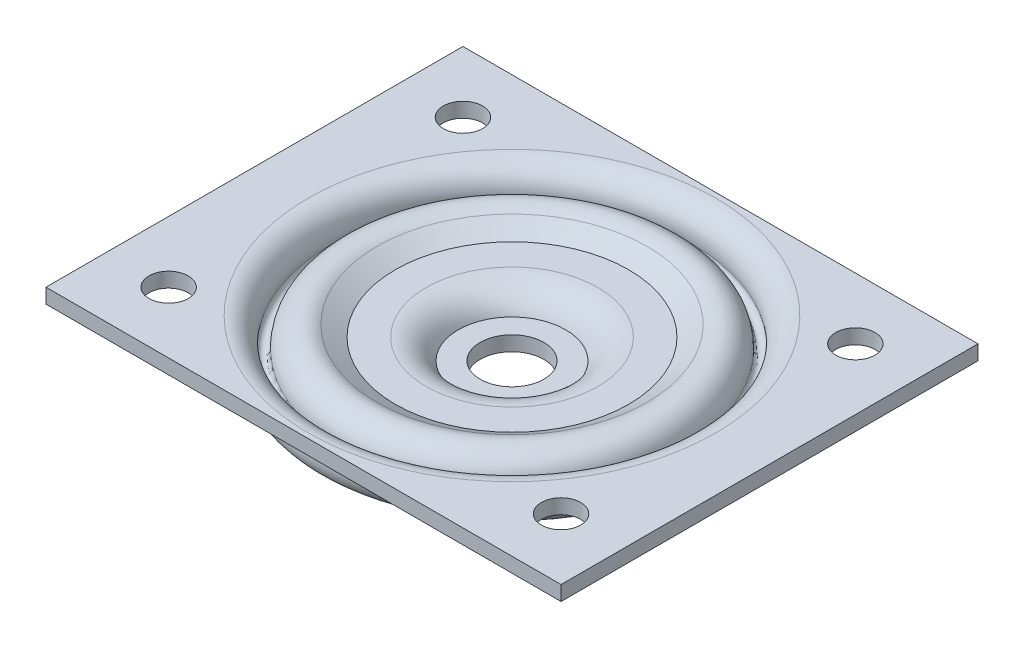
ISO-10303-21;
HEADER;
FILE_DESCRIPTION(('STEP AP214'),'2;1');
FILE_NAME('part.step','',(''),(''),'','','');
FILE_SCHEMA(('AUTOMOTIVE_DESIGN { 1 0 10303 214 1 1 1 1 }'));
ENDSEC;
DATA;
#1=APPLICATION_CONTEXT('core data for automotive mechanical design processes');
#2=APPLICATION_PROTOCOL_DEFINITION('international standard','automotive_design',2000,#1);
#3=PRODUCT_CONTEXT('',#1,'mechanical');
#4=PRODUCT('Part','Part','',(#3));
#5=PRODUCT_RELATED_PRODUCT_CATEGORY('part','',(#4));
#6=PRODUCT_DEFINITION_FORMATION('','',#4);
#7=PRODUCT_DEFINITION_CONTEXT('part definition',#1,'design');
#8=PRODUCT_DEFINITION('design','',#6,#7);
#9=PRODUCT_DEFINITION_SHAPE('','',#8);
#10=(LENGTH_UNIT() NAMED_UNIT(*) SI_UNIT(.MILLI.,.METRE.));
#11=(NAMED_UNIT(*) PLANE_ANGLE_UNIT() SI_UNIT($,.RADIAN.));
#12=(NAMED_UNIT(*) SI_UNIT($,.STERADIAN.) SOLID_ANGLE_UNIT());
#13=UNCERTAINTY_MEASURE_WITH_UNIT(LENGTH_MEASURE(1.E-05),#10,'distance_accuracy_value','');
#14=(GEOMETRIC_REPRESENTATION_CONTEXT(3) GLOBAL_UNCERTAINTY_ASSIGNED_CONTEXT((#13)) GLOBAL_UNIT_ASSIGNED_CONTEXT((#10,
#11,#12)) REPRESENTATION_CONTEXT('',''));
#15=CARTESIAN_POINT('',(0.,0.,0.));
#16=DIRECTION('',(0.,0.,1.));
#17=DIRECTION('',(1.,0.,0.));
#18=AXIS2_PLACEMENT_3D('',#15,#16,#17);
#19=CARTESIAN_POINT('',(41.5,11.,0.));
#20=DIRECTION('',(0.,1.,0.));
#21=DIRECTION('',(0.,0.,1.));
#22=AXIS2_PLACEMENT_3D('',#19,#20,#21);
#23=PLANE('',#22);
#24=CARTESIAN_POINT('',(-40.,11.,30.));
#25=DIRECTION('',(0.,1.,0.));
#26=DIRECTION('',(0.,0.,1.));
#27=AXIS2_PLACEMENT_3D('',#24,#25,#26);
#28=CIRCLE('',#27,4.00000000000001);
#29=CARTESIAN_POINT('',(-40.,11.,34.));
#30=VERTEX_POINT('',#29);
#31=EDGE_CURVE('E318',#30,#30,#28,.T.);
#32=ORIENTED_EDGE('',*,*,#31,.F.);
#33=EDGE_LOOP('',(#32));
#34=FACE_BOUND('',#33,.T.);
#35=CARTESIAN_POINT('',(40.,11.,30.));
#36=DIRECTION('',(0.,1.,0.));
#37=DIRECTION('',(0.,0.,1.));
#38=AXIS2_PLACEMENT_3D('',#35,#36,#37);
#39=CIRCLE('',#38,4.00000000000001);
#40=CARTESIAN_POINT('',(40.,11.,34.));
#41=VERTEX_POINT('',#40);
#42=EDGE_CURVE('E314',#41,#41,#39,.T.);
#43=ORIENTED_EDGE('',*,*,#42,.F.);
#44=EDGE_LOOP('',(#43));
#45=FACE_BOUND('',#44,.T.);
#46=CARTESIAN_POINT('',(40.,11.,-30.));
#47=DIRECTION('',(0.,1.,0.));
#48=DIRECTION('',(0.,0.,1.));
#49=AXIS2_PLACEMENT_3D('',#46,#47,#48);
#50=CIRCLE('',#49,4.00000000000001);
#51=CARTESIAN_POINT('',(40.,11.,-26.));
#52=VERTEX_POINT('',#51);
#53=EDGE_CURVE('E312',#52,#52,#50,.T.);
#54=ORIENTED_EDGE('',*,*,#53,.F.);
#55=EDGE_LOOP('',(#54));
#56=FACE_BOUND('',#55,.T.);
#57=CARTESIAN_POINT('',(-40.,11.,-30.));
#58=DIRECTION('',(0.,1.,0.));
#59=DIRECTION('',(0.,0.,1.));
#60=AXIS2_PLACEMENT_3D('',#57,#58,#59);
#61=CIRCLE('',#60,4.00000000000001);
#62=CARTESIAN_POINT('',(-40.,11.,-26.));
#63=VERTEX_POINT('',#62);
#64=EDGE_CURVE('E106',#63,#63,#61,.T.);
#65=ORIENTED_EDGE('',*,*,#64,.F.);
#66=EDGE_LOOP('',(#65));
#67=FACE_BOUND('',#66,.T.);
#68=CARTESIAN_POINT('',(0.,11.,0.));
#69=DIRECTION('',(0.,-1.,0.));
#70=DIRECTION('',(0.,0.,-1.));
#71=AXIS2_PLACEMENT_3D('',#68,#69,#70);
#72=CIRCLE('',#71,41.5);
#73=CARTESIAN_POINT('',(0.,11.,-41.5));
#74=VERTEX_POINT('',#73);
#75=EDGE_CURVE('E140',#74,#74,#72,.T.);
#76=ORIENTED_EDGE('',*,*,#75,.T.);
#77=EDGE_LOOP('',(#76));
#78=FACE_BOUND('',#77,.T.);
#79=DIRECTION('',(1.,0.,0.));
#80=VECTOR('',#79,1.);
#81=CARTESIAN_POINT('',(52.5,11.,42.5));
#82=LINE('',#81,#80);
#83=CARTESIAN_POINT('',(-52.500000043221,11.,42.5));
#84=VERTEX_POINT('',#83);
#85=CARTESIAN_POINT('',(52.5,11.,42.5));
#86=VERTEX_POINT('',#85);
#87=EDGE_CURVE('E116',#84,#86,#82,.T.);
#88=ORIENTED_EDGE('',*,*,#87,.T.);
#89=DIRECTION('',(0.,0.,1.));
#90=VECTOR('',#89,1.);
#91=CARTESIAN_POINT('',(52.5,11.,0.));
#92=LINE('',#91,#90);
#93=CARTESIAN_POINT('',(52.5,11.,-42.5));
#94=VERTEX_POINT('',#93);
#95=EDGE_CURVE('E95',#94,#86,#92,.T.);
#96=ORIENTED_EDGE('',*,*,#95,.F.);
#97=DIRECTION('',(-1.,0.,0.));
#98=VECTOR('',#97,1.);
#99=CARTESIAN_POINT('',(52.5,11.,-42.5));
#100=LINE('',#99,#98);
#101=CARTESIAN_POINT('',(-52.5000000432211,11.,-42.5));
#102=VERTEX_POINT('',#101);
#103=EDGE_CURVE('E56',#94,#102,#100,.T.);
#104=ORIENTED_EDGE('',*,*,#103,.T.);
#105=DIRECTION('',(0.,0.,1.));
#106=VECTOR('',#105,1.);
#107=CARTESIAN_POINT('',(-52.5000000432211,11.,0.));
#108=LINE('',#107,#106);
#109=EDGE_CURVE('E110',#102,#84,#108,.T.);
#110=ORIENTED_EDGE('',*,*,#109,.T.);
#111=EDGE_LOOP('',(#88,#96,#104,#110));
#112=FACE_BOUND('',#111,.T.);
#113=ADVANCED_FACE('F39',(#34,#45,#56,#67,#78,#112),#23,.T.);
#114=CARTESIAN_POINT('',(41.5,8.,0.));
#115=DIRECTION('',(0.,-1.,0.));
#116=DIRECTION('',(0.,0.,-1.));
#117=AXIS2_PLACEMENT_3D('',#114,#115,#116);
#118=PLANE('',#117);
#119=CARTESIAN_POINT('',(-40.,8.,30.));
#120=DIRECTION('',(0.,-1.,0.));
#121=DIRECTION('',(0.,0.,-1.));
#122=AXIS2_PLACEMENT_3D('',#119,#120,#121);
#123=CIRCLE('',#122,4.00000000000001);
#124=CARTESIAN_POINT('',(-40.,8.,26.));
#125=VERTEX_POINT('',#124);
#126=EDGE_CURVE('E43',#125,#125,#123,.T.);
#127=ORIENTED_EDGE('',*,*,#126,.F.);
#128=EDGE_LOOP('',(#127));
#129=FACE_BOUND('',#128,.T.);
#130=CARTESIAN_POINT('',(40.,8.,30.));
#131=DIRECTION('',(0.,-1.,0.));
#132=DIRECTION('',(0.,0.,-1.));
#133=AXIS2_PLACEMENT_3D('',#130,#131,#132);
#134=CIRCLE('',#133,4.00000000000001);
#135=CARTESIAN_POINT('',(40.,8.,26.));
#136=VERTEX_POINT('',#135);
#137=EDGE_CURVE('E103',#136,#136,#134,.T.);
#138=ORIENTED_EDGE('',*,*,#137,.F.);
#139=EDGE_LOOP('',(#138));
#140=FACE_BOUND('',#139,.T.);
#141=CARTESIAN_POINT('',(40.,8.,-30.));
#142=DIRECTION('',(0.,-1.,0.));
#143=DIRECTION('',(0.,0.,-1.));
#144=AXIS2_PLACEMENT_3D('',#141,#142,#143);
#145=CIRCLE('',#144,4.00000000000001);
#146=CARTESIAN_POINT('',(40.,8.,-34.));
#147=VERTEX_POINT('',#146);
#148=EDGE_CURVE('E169',#147,#147,#145,.T.);
#149=ORIENTED_EDGE('',*,*,#148,.F.);
#150=EDGE_LOOP('',(#149));
#151=FACE_BOUND('',#150,.T.);
#152=CARTESIAN_POINT('',(-40.,8.,-30.));
#153=DIRECTION('',(0.,-1.,0.));
#154=DIRECTION('',(0.,0.,-1.));
#155=AXIS2_PLACEMENT_3D('',#152,#153,#154);
#156=CIRCLE('',#155,4.00000000000001);
#157=CARTESIAN_POINT('',(-40.,8.,-34.));
#158=VERTEX_POINT('',#157);
#159=EDGE_CURVE('E166',#158,#158,#156,.T.);
#160=ORIENTED_EDGE('',*,*,#159,.F.);
#161=EDGE_LOOP('',(#160));
#162=FACE_BOUND('',#161,.T.);
#163=CARTESIAN_POINT('',(0.,8.,0.));
#164=DIRECTION('',(0.,-1.,0.));
#165=DIRECTION('',(0.,0.,-1.));
#166=AXIS2_PLACEMENT_3D('',#163,#164,#165);
#167=CIRCLE('',#166,41.5);
#168=CARTESIAN_POINT('',(0.,8.,-41.5));
#169=VERTEX_POINT('',#168);
#170=EDGE_CURVE('E137',#169,#169,#167,.T.);
#171=ORIENTED_EDGE('',*,*,#170,.F.);
#172=EDGE_LOOP('',(#171));
#173=FACE_BOUND('',#172,.T.);
#174=DIRECTION('',(-1.,0.,0.));
#175=VECTOR('',#174,1.);
#176=CARTESIAN_POINT('',(41.5,8.,42.5));
#177=LINE('',#176,#175);
#178=CARTESIAN_POINT('',(52.5,8.,42.5));
#179=VERTEX_POINT('',#178);
#180=CARTESIAN_POINT('',(-52.500000043221,8.,42.5));
#181=VERTEX_POINT('',#180);
#182=EDGE_CURVE('E49',#179,#181,#177,.T.);
#183=ORIENTED_EDGE('',*,*,#182,.T.);
#184=DIRECTION('',(0.,0.,1.));
#185=VECTOR('',#184,1.);
#186=CARTESIAN_POINT('',(-52.5000000432211,8.,0.));
#187=LINE('',#186,#185);
#188=CARTESIAN_POINT('',(-52.5000000432211,8.,-42.5));
#189=VERTEX_POINT('',#188);
#190=EDGE_CURVE('E112',#189,#181,#187,.T.);
#191=ORIENTED_EDGE('',*,*,#190,.F.);
#192=DIRECTION('',(1.,0.,0.));
#193=VECTOR('',#192,1.);
#194=CARTESIAN_POINT('',(41.5,8.,-42.5));
#195=LINE('',#194,#193);
#196=CARTESIAN_POINT('',(52.5,8.,-42.5));
#197=VERTEX_POINT('',#196);
#198=EDGE_CURVE('E12',#189,#197,#195,.T.);
#199=ORIENTED_EDGE('',*,*,#198,.T.);
#200=DIRECTION('',(0.,0.,1.));
#201=VECTOR('',#200,1.);
#202=CARTESIAN_POINT('',(52.5,8.,0.));
#203=LINE('',#202,#201);
#204=EDGE_CURVE('E90',#197,#179,#203,.T.);
#205=ORIENTED_EDGE('',*,*,#204,.T.);
#206=EDGE_LOOP('',(#183,#191,#199,#205));
#207=FACE_BOUND('',#206,.T.);
#208=ADVANCED_FACE('F91',(#129,#140,#151,#162,#173,#207),#118,.T.);
#209=CARTESIAN_POINT('',(6.5,0.,0.));
#210=DIRECTION('',(0.,-1.,0.));
#211=DIRECTION('',(0.,0.,-1.));
#212=AXIS2_PLACEMENT_3D('',#209,#210,#211);
#213=PLANE('',#212);
#214=CARTESIAN_POINT('',(0.,0.,0.));
#215=DIRECTION('',(0.,-1.,0.));
#216=DIRECTION('',(0.,0.,-1.));
#217=AXIS2_PLACEMENT_3D('',#214,#215,#216);
#218=CIRCLE('',#217,13.3);
#219=CARTESIAN_POINT('',(0.,0.,-13.3));
#220=VERTEX_POINT('',#219);
#221=EDGE_CURVE('E119',#220,#220,#218,.T.);
#222=ORIENTED_EDGE('',*,*,#221,.T.);
#223=EDGE_LOOP('',(#222));
#224=FACE_BOUND('',#223,.T.);
#225=CARTESIAN_POINT('',(0.,0.,0.));
#226=DIRECTION('',(0.,-1.,0.));
#227=DIRECTION('',(0.,0.,-1.));
#228=AXIS2_PLACEMENT_3D('',#225,#226,#227);
#229=CIRCLE('',#228,6.5);
#230=CARTESIAN_POINT('',(0.,0.,-6.5));
#231=VERTEX_POINT('',#230);
#232=EDGE_CURVE('E87',#231,#231,#229,.T.);
#233=ORIENTED_EDGE('',*,*,#232,.F.);
#234=EDGE_LOOP('',(#233));
#235=FACE_BOUND('',#234,.T.);
#236=ADVANCED_FACE('F41',(#224,#235),#213,.T.);
#237=CARTESIAN_POINT('',(0.,0.,0.));
#238=DIRECTION('',(0.,-1.,0.));
#239=DIRECTION('',(0.,0.,-1.));
#240=AXIS2_PLACEMENT_3D('',#237,#238,#239);
#241=CYLINDRICAL_SURFACE('',#240,6.5);
#242=ORIENTED_EDGE('',*,*,#232,.T.);
#243=EDGE_LOOP('',(#242));
#244=FACE_BOUND('',#243,.T.);
#245=CARTESIAN_POINT('',(0.,3.,0.));
#246=DIRECTION('',(0.,-1.,0.));
#247=DIRECTION('',(0.,0.,-1.));
#248=AXIS2_PLACEMENT_3D('',#245,#246,#247);
#249=CIRCLE('',#248,6.5);
#250=CARTESIAN_POINT('',(0.,3.,-6.5));
#251=VERTEX_POINT('',#250);
#252=EDGE_CURVE('E161',#251,#251,#249,.T.);
#253=ORIENTED_EDGE('',*,*,#252,.F.);
#254=EDGE_LOOP('',(#253));
#255=FACE_BOUND('',#254,.T.);
#256=ADVANCED_FACE('F226',(#244,#255),#241,.F.);
#257=CARTESIAN_POINT('',(6.5,3.,0.));
#258=DIRECTION('',(0.,1.,0.));
#259=DIRECTION('',(0.,0.,1.));
#260=AXIS2_PLACEMENT_3D('',#257,#258,#259);
#261=PLANE('',#260);
#262=ORIENTED_EDGE('',*,*,#252,.T.);
#263=EDGE_LOOP('',(#262));
#264=FACE_BOUND('',#263,.T.);
#265=CARTESIAN_POINT('',(0.,3.,0.));
#266=DIRECTION('',(0.,-1.,0.));
#267=DIRECTION('',(0.,0.,-1.));
#268=AXIS2_PLACEMENT_3D('',#265,#266,#267);
#269=CIRCLE('',#268,10.9547727312186);
#270=CARTESIAN_POINT('',(0.,3.,-10.9547727312186));
#271=VERTEX_POINT('',#270);
#272=EDGE_CURVE('E158',#271,#271,#269,.T.);
#273=ORIENTED_EDGE('',*,*,#272,.F.);
#274=EDGE_LOOP('',(#273));
#275=FACE_BOUND('',#274,.T.);
#276=ADVANCED_FACE('F231',(#264,#275),#261,.T.);
#277=CARTESIAN_POINT('',(0.,0.,0.));
#278=DIRECTION('',(0.,-1.,0.));
#279=DIRECTION('',(0.,0.,-1.));
#280=AXIS2_PLACEMENT_3D('',#277,#278,#279);
#281=TOROIDAL_SURFACE('',#280,17.5,7.2);
#282=ORIENTED_EDGE('',*,*,#272,.T.);
#283=EDGE_LOOP('',(#282));
#284=FACE_BOUND('',#283,.T.);
#285=CARTESIAN_POINT('',(0.,7.2,0.));
#286=DIRECTION('',(0.,-1.,0.));
#287=DIRECTION('',(0.,0.,-1.));
#288=AXIS2_PLACEMENT_3D('',#285,#286,#287);
#289=CIRCLE('',#288,17.5);
#290=CARTESIAN_POINT('',(0.,7.2,-17.5));
#291=VERTEX_POINT('',#290);
#292=EDGE_CURVE('E155',#291,#291,#289,.T.);
#293=ORIENTED_EDGE('',*,*,#292,.F.);
#294=EDGE_LOOP('',(#293));
#295=FACE_BOUND('',#294,.T.);
#296=ADVANCED_FACE('F236',(#284,#295),#281,.T.);
#297=CARTESIAN_POINT('',(17.5,7.2,0.));
#298=DIRECTION('',(0.,1.,0.));
#299=DIRECTION('',(0.,0.,1.));
#300=AXIS2_PLACEMENT_3D('',#297,#298,#299);
#301=PLANE('',#300);
#302=ORIENTED_EDGE('',*,*,#292,.T.);
#303=EDGE_LOOP('',(#302));
#304=FACE_BOUND('',#303,.T.);
#305=CARTESIAN_POINT('',(0.,7.2,0.));
#306=DIRECTION('',(0.,-1.,0.));
#307=DIRECTION('',(0.,0.,-1.));
#308=AXIS2_PLACEMENT_3D('',#305,#306,#307);
#309=CIRCLE('',#308,23.7791125789599);
#310=CARTESIAN_POINT('',(0.,7.2,-23.7791125789599));
#311=VERTEX_POINT('',#310);
#312=EDGE_CURVE('E152',#311,#311,#309,.T.);
#313=ORIENTED_EDGE('',*,*,#312,.F.);
#314=EDGE_LOOP('',(#313));
#315=FACE_BOUND('',#314,.T.);
#316=ADVANCED_FACE('F242',(#304,#315),#301,.T.);
#317=CARTESIAN_POINT('',(0.,9.42957114887785,0.));
#318=DIRECTION('',(0.,1.,0.));
#319=DIRECTION('',(0.,0.,1.));
#320=AXIS2_PLACEMENT_3D('',#317,#318,#319);
#321=CONICAL_SURFACE('',#320,27.5481495211106,1.03661375188951);
#322=ORIENTED_EDGE('',*,*,#312,.T.);
#323=EDGE_LOOP('',(#322));
#324=FACE_BOUND('',#323,.T.);
#325=CARTESIAN_POINT('',(0.,9.42957114887785,0.));
#326=DIRECTION('',(0.,-1.,0.));
#327=DIRECTION('',(0.,0.,-1.));
#328=AXIS2_PLACEMENT_3D('',#325,#326,#327);
#329=CIRCLE('',#328,27.5481495211106);
#330=CARTESIAN_POINT('',(0.,9.42957114887785,-27.5481495211106));
#331=VERTEX_POINT('',#330);
#332=EDGE_CURVE('E149',#331,#331,#329,.T.);
#333=ORIENTED_EDGE('',*,*,#332,.F.);
#334=EDGE_LOOP('',(#333));
#335=FACE_BOUND('',#334,.T.);
#336=ADVANCED_FACE('F248',(#324,#335),#321,.F.);
#337=CARTESIAN_POINT('',(0.,5.28458748990371,0.));
#338=DIRECTION('',(0.,-1.,0.));
#339=DIRECTION('',(0.,0.,-1.));
#340=AXIS2_PLACEMENT_3D('',#337,#338,#339);
#341=TOROIDAL_SURFACE('',#340,30.0001116855741,4.81591195819895);
#342=ORIENTED_EDGE('',*,*,#332,.T.);
#343=EDGE_LOOP('',(#342));
#344=FACE_BOUND('',#343,.T.);
#345=CARTESIAN_POINT('',(0.,5.0388465615535,0.));
#346=DIRECTION('',(0.,-1.,0.));
#347=DIRECTION('',(0.,0.,-1.));
#348=AXIS2_PLACEMENT_3D('',#345,#346,#347);
#349=CIRCLE('',#348,34.809749861701);
#350=CARTESIAN_POINT('',(0.,5.0388465615535,-34.809749861701));
#351=VERTEX_POINT('',#350);
#352=EDGE_CURVE('E146',#351,#351,#349,.T.);
#353=ORIENTED_EDGE('',*,*,#352,.F.);
#354=EDGE_LOOP('',(#353));
#355=FACE_BOUND('',#354,.T.);
#356=ADVANCED_FACE('F254',(#344,#355),#341,.T.);
#357=CARTESIAN_POINT('',(0.,4.98781968845384,0.));
#358=DIRECTION('',(0.,-1.,0.));
#359=DIRECTION('',(0.,0.,-1.));
#360=AXIS2_PLACEMENT_3D('',#357,#358,#359);
#361=TOROIDAL_SURFACE('',#360,35.8084471422729,0.999999999999998);
#362=ORIENTED_EDGE('',*,*,#352,.T.);
#363=EDGE_LOOP('',(#362));
#364=FACE_BOUND('',#363,.T.);
#365=CARTESIAN_POINT('',(0.,5.19350855753322,0.));
#366=DIRECTION('',(0.,-1.,0.));
#367=DIRECTION('',(0.,0.,-1.));
#368=AXIS2_PLACEMENT_3D('',#365,#366,#367);
#369=CIRCLE('',#368,36.7870645798535);
#370=CARTESIAN_POINT('',(0.,5.19350855753322,-36.7870645798535));
#371=VERTEX_POINT('',#370);
#372=EDGE_CURVE('E143',#371,#371,#369,.T.);
#373=ORIENTED_EDGE('',*,*,#372,.F.);
#374=EDGE_LOOP('',(#373));
#375=FACE_BOUND('',#374,.T.);
#376=ADVANCED_FACE('F260',(#364,#375),#361,.F.);
#377=CARTESIAN_POINT('',(0.,6.18408804180105,0.));
#378=DIRECTION('',(0.,-1.,0.));
#379=DIRECTION('',(0.,0.,-1.));
#380=AXIS2_PLACEMENT_3D('',#377,#378,#379);
#381=TOROIDAL_SURFACE('',#380,41.5,4.81591195819894);
#382=ORIENTED_EDGE('',*,*,#372,.T.);
#383=EDGE_LOOP('',(#382));
#384=FACE_BOUND('',#383,.T.);
#385=ORIENTED_EDGE('',*,*,#75,.F.);
#386=EDGE_LOOP('',(#385));
#387=FACE_BOUND('',#386,.T.);
#388=ADVANCED_FACE('F191',(#384,#387),#381,.T.);
#389=CARTESIAN_POINT('',(0.,6.18408804180105,0.));
#390=DIRECTION('',(0.,-1.,0.));
#391=DIRECTION('',(0.,0.,-1.));
#392=AXIS2_PLACEMENT_3D('',#389,#390,#391);
#393=TOROIDAL_SURFACE('',#392,41.5,1.81591195819894);
#394=ORIENTED_EDGE('',*,*,#170,.T.);
#395=EDGE_LOOP('',(#394));
#396=FACE_BOUND('',#395,.T.);
#397=CARTESIAN_POINT('',(0.,5.81057516477138,0.));
#398=DIRECTION('',(0.,-1.,0.));
#399=DIRECTION('',(0.,0.,-1.));
#400=AXIS2_PLACEMENT_3D('',#397,#398,#399);
#401=CIRCLE('',#400,39.7229168925954);
#402=CARTESIAN_POINT('',(0.,5.81057516477138,-39.7229168925954));
#403=VERTEX_POINT('',#402);
#404=EDGE_CURVE('E134',#403,#403,#401,.T.);
#405=ORIENTED_EDGE('',*,*,#404,.F.);
#406=EDGE_LOOP('',(#405));
#407=FACE_BOUND('',#406,.T.);
#408=ADVANCED_FACE('F187',(#396,#407),#393,.F.);
#409=CARTESIAN_POINT('',(0.,4.98781968845384,0.));
#410=DIRECTION('',(0.,-1.,0.));
#411=DIRECTION('',(0.,0.,-1.));
#412=AXIS2_PLACEMENT_3D('',#409,#410,#411);
#413=TOROIDAL_SURFACE('',#412,35.8084471422729,4.);
#414=ORIENTED_EDGE('',*,*,#404,.T.);
#415=EDGE_LOOP('',(#414));
#416=FACE_BOUND('',#415,.T.);
#417=CARTESIAN_POINT('',(0.,5.19192718085252,0.));
#418=DIRECTION('',(0.,-1.,0.));
#419=DIRECTION('',(0.,0.,-1.));
#420=AXIS2_PLACEMENT_3D('',#417,#418,#419);
#421=CIRCLE('',#420,31.8136580199854);
#422=CARTESIAN_POINT('',(0.,5.19192718085252,-31.8136580199854));
#423=VERTEX_POINT('',#422);
#424=EDGE_CURVE('E131',#423,#423,#421,.T.);
#425=ORIENTED_EDGE('',*,*,#424,.F.);
#426=EDGE_LOOP('',(#425));
#427=FACE_BOUND('',#426,.T.);
#428=ADVANCED_FACE('F190',(#416,#427),#413,.T.);
#429=CARTESIAN_POINT('',(0.,5.28458748990371,0.));
#430=DIRECTION('',(0.,-1.,0.));
#431=DIRECTION('',(0.,0.,-1.));
#432=AXIS2_PLACEMENT_3D('',#429,#430,#431);
#433=TOROIDAL_SURFACE('',#432,30.0001116855741,1.81591195819895);
#434=ORIENTED_EDGE('',*,*,#424,.T.);
#435=EDGE_LOOP('',(#434));
#436=FACE_BOUND('',#435,.T.);
#437=CARTESIAN_POINT('',(0.,6.84751585283942,0.));
#438=DIRECTION('',(0.,-1.,0.));
#439=DIRECTION('',(0.,0.,-1.));
#440=AXIS2_PLACEMENT_3D('',#437,#438,#439);
#441=CIRCLE('',#440,29.0755625131333);
#442=CARTESIAN_POINT('',(0.,6.84751585283942,-29.0755625131333));
#443=VERTEX_POINT('',#442);
#444=EDGE_CURVE('E128',#443,#443,#441,.T.);
#445=ORIENTED_EDGE('',*,*,#444,.F.);
#446=EDGE_LOOP('',(#445));
#447=FACE_BOUND('',#446,.T.);
#448=ADVANCED_FACE('F197',(#436,#447),#433,.F.);
#449=CARTESIAN_POINT('',(0.,4.2,0.));
#450=DIRECTION('',(0.,1.,0.));
#451=DIRECTION('',(0.,0.,1.));
#452=AXIS2_PLACEMENT_3D('',#449,#450,#451);
#453=CONICAL_SURFACE('',#452,24.6,1.03661375188951);
#454=ORIENTED_EDGE('',*,*,#444,.T.);
#455=EDGE_LOOP('',(#454));
#456=FACE_BOUND('',#455,.T.);
#457=CARTESIAN_POINT('',(0.,4.2,0.));
#458=DIRECTION('',(0.,-1.,0.));
#459=DIRECTION('',(0.,0.,-1.));
#460=AXIS2_PLACEMENT_3D('',#457,#458,#459);
#461=CIRCLE('',#460,24.6);
#462=CARTESIAN_POINT('',(0.,4.2,-24.6));
#463=VERTEX_POINT('',#462);
#464=EDGE_CURVE('E125',#463,#463,#461,.T.);
#465=ORIENTED_EDGE('',*,*,#464,.F.);
#466=EDGE_LOOP('',(#465));
#467=FACE_BOUND('',#466,.T.);
#468=ADVANCED_FACE('F203',(#456,#467),#453,.T.);
#469=CARTESIAN_POINT('',(17.5,4.2,0.));
#470=DIRECTION('',(0.,-1.,0.));
#471=DIRECTION('',(0.,0.,-1.));
#472=AXIS2_PLACEMENT_3D('',#469,#470,#471);
#473=PLANE('',#472);
#474=ORIENTED_EDGE('',*,*,#464,.T.);
#475=EDGE_LOOP('',(#474));
#476=FACE_BOUND('',#475,.T.);
#477=CARTESIAN_POINT('',(0.,4.2,0.));
#478=DIRECTION('',(0.,-1.,0.));
#479=DIRECTION('',(0.,0.,-1.));
#480=AXIS2_PLACEMENT_3D('',#477,#478,#479);
#481=CIRCLE('',#480,17.5);
#482=CARTESIAN_POINT('',(0.,4.2,-17.5));
#483=VERTEX_POINT('',#482);
#484=EDGE_CURVE('E122',#483,#483,#481,.T.);
#485=ORIENTED_EDGE('',*,*,#484,.F.);
#486=EDGE_LOOP('',(#485));
#487=FACE_BOUND('',#486,.T.);
#488=ADVANCED_FACE('F209',(#476,#487),#473,.T.);
#489=CARTESIAN_POINT('',(0.,0.,0.));
#490=DIRECTION('',(0.,-1.,0.));
#491=DIRECTION('',(0.,0.,-1.));
#492=AXIS2_PLACEMENT_3D('',#489,#490,#491);
#493=TOROIDAL_SURFACE('',#492,17.5,4.2);
#494=ORIENTED_EDGE('',*,*,#484,.T.);
#495=EDGE_LOOP('',(#494));
#496=FACE_BOUND('',#495,.T.);
#497=ORIENTED_EDGE('',*,*,#221,.F.);
#498=EDGE_LOOP('',(#497));
#499=FACE_BOUND('',#498,.T.);
#500=ADVANCED_FACE('F215',(#496,#499),#493,.F.);
#501=CARTESIAN_POINT('',(52.5,0.999999999999997,42.5));
#502=DIRECTION('',(0.,0.,1.));
#503=DIRECTION('',(1.,0.,0.));
#504=AXIS2_PLACEMENT_3D('',#501,#502,#503);
#505=PLANE('',#504);
#506=ORIENTED_EDGE('',*,*,#182,.F.);
#507=DIRECTION('',(0.,1.,0.));
#508=VECTOR('',#507,1.);
#509=CARTESIAN_POINT('',(52.5,-39.7093560039871,42.5));
#510=LINE('',#509,#508);
#511=EDGE_CURVE('E81',#179,#86,#510,.T.);
#512=ORIENTED_EDGE('',*,*,#511,.T.);
#513=ORIENTED_EDGE('',*,*,#87,.F.);
#514=DIRECTION('',(0.,1.,0.));
#515=VECTOR('',#514,1.);
#516=CARTESIAN_POINT('',(-52.500000043221,-39.7093560039871,42.5));
#517=LINE('',#516,#515);
#518=EDGE_CURVE('E83',#181,#84,#517,.T.);
#519=ORIENTED_EDGE('',*,*,#518,.F.);
#520=EDGE_LOOP('',(#506,#512,#513,#519));
#521=FACE_BOUND('',#520,.T.);
#522=ADVANCED_FACE('F79',(#521),#505,.T.);
#523=CARTESIAN_POINT('',(52.5,0.999999999999997,-42.5));
#524=DIRECTION('',(0.,0.,-1.));
#525=DIRECTION('',(-1.,0.,0.));
#526=AXIS2_PLACEMENT_3D('',#523,#524,#525);
#527=PLANE('',#526);
#528=ORIENTED_EDGE('',*,*,#198,.F.);
#529=DIRECTION('',(0.,1.,0.));
#530=VECTOR('',#529,1.);
#531=CARTESIAN_POINT('',(-52.5000000432211,-39.7093560039871,-42.5));
#532=LINE('',#531,#530);
#533=EDGE_CURVE('E114',#189,#102,#532,.T.);
#534=ORIENTED_EDGE('',*,*,#533,.T.);
#535=ORIENTED_EDGE('',*,*,#103,.F.);
#536=DIRECTION('',(0.,1.,0.));
#537=VECTOR('',#536,1.);
#538=CARTESIAN_POINT('',(52.5,-39.7093560039871,-42.5));
#539=LINE('',#538,#537);
#540=EDGE_CURVE('E99',#197,#94,#539,.T.);
#541=ORIENTED_EDGE('',*,*,#540,.F.);
#542=EDGE_LOOP('',(#528,#534,#535,#541));
#543=FACE_BOUND('',#542,.T.);
#544=ADVANCED_FACE('F282',(#543),#527,.T.);
#545=CARTESIAN_POINT('',(-52.5000000432211,-39.7093560039871,0.));
#546=DIRECTION('',(-1.,0.,0.));
#547=DIRECTION('',(0.,0.,1.));
#548=AXIS2_PLACEMENT_3D('',#545,#546,#547);
#549=PLANE('',#548);
#550=ORIENTED_EDGE('',*,*,#533,.F.);
#551=ORIENTED_EDGE('',*,*,#190,.T.);
#552=ORIENTED_EDGE('',*,*,#518,.T.);
#553=ORIENTED_EDGE('',*,*,#109,.F.);
#554=EDGE_LOOP('',(#550,#551,#552,#553));
#555=FACE_BOUND('',#554,.T.);
#556=ADVANCED_FACE('F280',(#555),#549,.T.);
#557=CARTESIAN_POINT('',(52.5,-39.7093560039871,0.));
#558=DIRECTION('',(-1.,0.,0.));
#559=DIRECTION('',(0.,0.,1.));
#560=AXIS2_PLACEMENT_3D('',#557,#558,#559);
#561=PLANE('',#560);
#562=ORIENTED_EDGE('',*,*,#204,.F.);
#563=ORIENTED_EDGE('',*,*,#540,.T.);
#564=ORIENTED_EDGE('',*,*,#95,.T.);
#565=ORIENTED_EDGE('',*,*,#511,.F.);
#566=EDGE_LOOP('',(#562,#563,#564,#565));
#567=FACE_BOUND('',#566,.T.);
#568=ADVANCED_FACE('F98',(#567),#561,.F.);
#569=CARTESIAN_POINT('',(-40.,0.,-30.));
#570=DIRECTION('',(0.,1.,0.));
#571=DIRECTION('',(0.,0.,1.));
#572=AXIS2_PLACEMENT_3D('',#569,#570,#571);
#573=CYLINDRICAL_SURFACE('',#572,4.00000000000001);
#574=ORIENTED_EDGE('',*,*,#159,.T.);
#575=EDGE_LOOP('',(#574));
#576=FACE_BOUND('',#575,.T.);
#577=ORIENTED_EDGE('',*,*,#64,.T.);
#578=EDGE_LOOP('',(#577));
#579=FACE_BOUND('',#578,.T.);
#580=ADVANCED_FACE('F294',(#576,#579),#573,.F.);
#581=CARTESIAN_POINT('',(40.,0.,-30.));
#582=DIRECTION('',(0.,1.,0.));
#583=DIRECTION('',(0.,0.,1.));
#584=AXIS2_PLACEMENT_3D('',#581,#582,#583);
#585=CYLINDRICAL_SURFACE('',#584,4.00000000000001);
#586=ORIENTED_EDGE('',*,*,#148,.T.);
#587=EDGE_LOOP('',(#586));
#588=FACE_BOUND('',#587,.T.);
#589=ORIENTED_EDGE('',*,*,#53,.T.);
#590=EDGE_LOOP('',(#589));
#591=FACE_BOUND('',#590,.T.);
#592=ADVANCED_FACE('F297',(#588,#591),#585,.F.);
#593=CARTESIAN_POINT('',(40.,0.,30.));
#594=DIRECTION('',(0.,1.,0.));
#595=DIRECTION('',(0.,0.,1.));
#596=AXIS2_PLACEMENT_3D('',#593,#594,#595);
#597=CYLINDRICAL_SURFACE('',#596,4.00000000000001);
#598=ORIENTED_EDGE('',*,*,#137,.T.);
#599=EDGE_LOOP('',(#598));
#600=FACE_BOUND('',#599,.T.);
#601=ORIENTED_EDGE('',*,*,#42,.T.);
#602=EDGE_LOOP('',(#601));
#603=FACE_BOUND('',#602,.T.);
#604=ADVANCED_FACE('F174',(#600,#603),#597,.F.);
#605=CARTESIAN_POINT('',(-40.,0.,30.));
#606=DIRECTION('',(0.,1.,0.));
#607=DIRECTION('',(0.,0.,1.));
#608=AXIS2_PLACEMENT_3D('',#605,#606,#607);
#609=CYLINDRICAL_SURFACE('',#608,4.00000000000001);
#610=ORIENTED_EDGE('',*,*,#126,.T.);
#611=EDGE_LOOP('',(#610));
#612=FACE_BOUND('',#611,.T.);
#613=ORIENTED_EDGE('',*,*,#31,.T.);
#614=EDGE_LOOP('',(#613));
#615=FACE_BOUND('',#614,.T.);
#616=ADVANCED_FACE('F299',(#612,#615),#609,.F.);
#617=CLOSED_SHELL('',(#113,#208,#236,#256,#276,#296,#316,#336,#356,#376,#388,#408,#428,#448,
#468,#488,#500,#522,#544,#556,#568,#580,#592,#604,#616));
#618=MANIFOLD_SOLID_BREP('B2',#617);
#619=ADVANCED_BREP_SHAPE_REPRESENTATION('',(#18,#618),#14);
#620=SHAPE_DEFINITION_REPRESENTATION(#9,#619);
ENDSEC;
END-ISO-10303-21;
